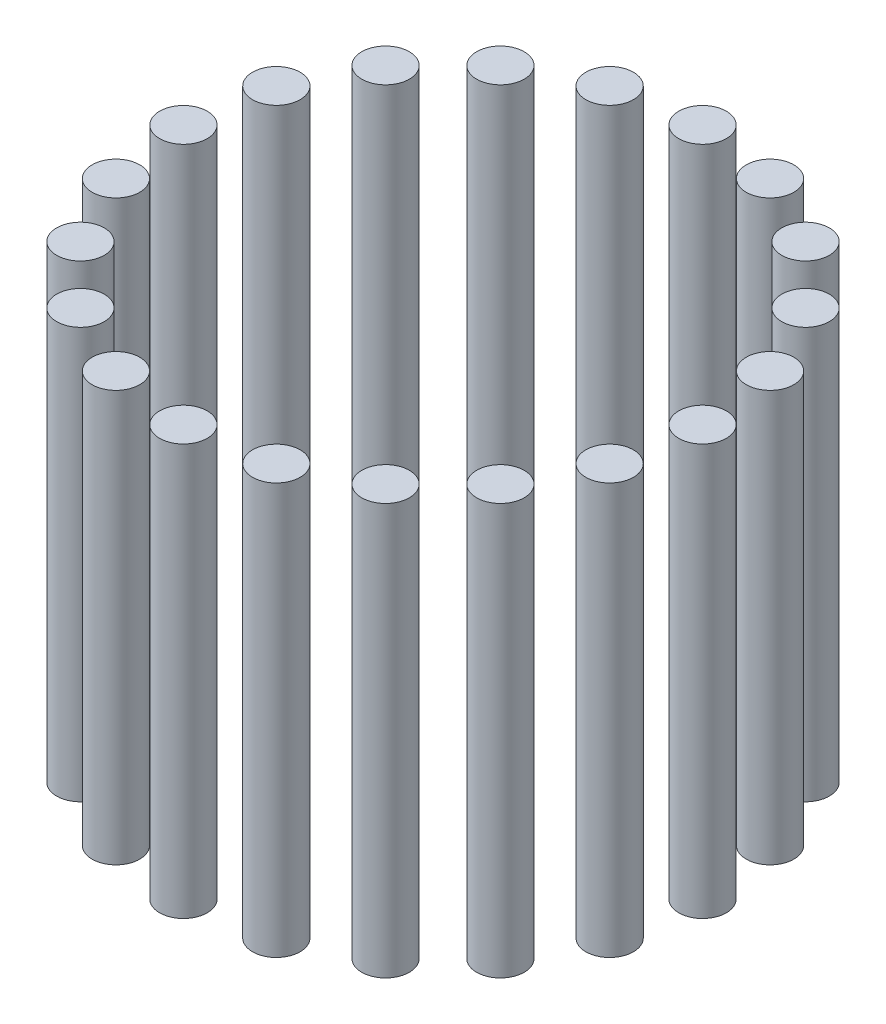
ISO-10303-21;
HEADER;
FILE_DESCRIPTION(('STEP AP214'),'2;1');
FILE_NAME('part.step','',(''),(''),'','','');
FILE_SCHEMA(('AUTOMOTIVE_DESIGN { 1 0 10303 214 1 1 1 1 }'));
ENDSEC;
DATA;
#1=APPLICATION_CONTEXT('core data for automotive mechanical design processes');
#2=APPLICATION_PROTOCOL_DEFINITION('international standard','automotive_design',2000,#1);
#3=PRODUCT_CONTEXT('',#1,'mechanical');
#4=PRODUCT('Part','Part','',(#3));
#5=PRODUCT_RELATED_PRODUCT_CATEGORY('part','',(#4));
#6=PRODUCT_DEFINITION_FORMATION('','',#4);
#7=PRODUCT_DEFINITION_CONTEXT('part definition',#1,'design');
#8=PRODUCT_DEFINITION('design','',#6,#7);
#9=PRODUCT_DEFINITION_SHAPE('','',#8);
#10=(LENGTH_UNIT() NAMED_UNIT(*) SI_UNIT(.MILLI.,.METRE.));
#11=(NAMED_UNIT(*) PLANE_ANGLE_UNIT() SI_UNIT($,.RADIAN.));
#12=(NAMED_UNIT(*) SI_UNIT($,.STERADIAN.) SOLID_ANGLE_UNIT());
#13=UNCERTAINTY_MEASURE_WITH_UNIT(LENGTH_MEASURE(1.E-05),#10,'distance_accuracy_value','');
#14=(GEOMETRIC_REPRESENTATION_CONTEXT(3) GLOBAL_UNCERTAINTY_ASSIGNED_CONTEXT((#13)) GLOBAL_UNIT_ASSIGNED_CONTEXT((#10,
#11,#12)) REPRESENTATION_CONTEXT('',''));
#15=CARTESIAN_POINT('',(0.,0.,0.));
#16=DIRECTION('',(0.,0.,1.));
#17=DIRECTION('',(1.,0.,0.));
#18=AXIS2_PLACEMENT_3D('',#15,#16,#17);
#19=CARTESIAN_POINT('',(0.,0.,0.));
#20=DIRECTION('',(0.,1.,0.));
#21=DIRECTION('',(0.,0.,1.));
#22=AXIS2_PLACEMENT_3D('',#19,#20,#21);
#23=PLANE('',#22);
#24=CARTESIAN_POINT('',(-57.0633909777092,0.,-18.5410196624969));
#25=DIRECTION('',(0.,1.,0.));
#26=DIRECTION('',(0.,0.,1.));
#27=AXIS2_PLACEMENT_3D('',#24,#25,#26);
#28=CIRCLE('',#27,5.5);
#29=CARTESIAN_POINT('',(-57.0633909777092,0.,-13.0410196624969));
#30=VERTEX_POINT('',#29);
#31=EDGE_CURVE('E12',#30,#30,#28,.T.);
#32=ORIENTED_EDGE('',*,*,#31,.F.);
#33=EDGE_LOOP('',(#32));
#34=FACE_BOUND('',#33,.T.);
#35=ADVANCED_FACE('F55',(#34),#23,.F.);
#36=CARTESIAN_POINT('',(-57.0633909777092,95.,-18.5410196624969));
#37=DIRECTION('',(0.,-1.,0.));
#38=DIRECTION('',(0.,0.,-1.));
#39=AXIS2_PLACEMENT_3D('',#36,#37,#38);
#40=CYLINDRICAL_SURFACE('',#39,5.5);
#41=ORIENTED_EDGE('',*,*,#31,.T.);
#42=EDGE_LOOP('',(#41));
#43=FACE_BOUND('',#42,.T.);
#44=CARTESIAN_POINT('',(-57.0633909777092,95.,-18.5410196624969));
#45=DIRECTION('',(0.,1.,0.));
#46=DIRECTION('',(0.,0.,1.));
#47=AXIS2_PLACEMENT_3D('',#44,#45,#46);
#48=CIRCLE('',#47,5.5);
#49=CARTESIAN_POINT('',(-57.0633909777092,95.,-13.0410196624969));
#50=VERTEX_POINT('',#49);
#51=EDGE_CURVE('E59',#50,#50,#48,.T.);
#52=ORIENTED_EDGE('',*,*,#51,.F.);
#53=EDGE_LOOP('',(#52));
#54=FACE_BOUND('',#53,.T.);
#55=ADVANCED_FACE('F69',(#43,#54),#40,.T.);
#56=CARTESIAN_POINT('',(0.,95.,0.));
#57=DIRECTION('',(0.,1.,0.));
#58=DIRECTION('',(0.,0.,1.));
#59=AXIS2_PLACEMENT_3D('',#56,#57,#58);
#60=PLANE('',#59);
#61=ORIENTED_EDGE('',*,*,#51,.T.);
#62=EDGE_LOOP('',(#61));
#63=FACE_BOUND('',#62,.T.);
#64=ADVANCED_FACE('F57',(#63),#60,.T.);
#65=CLOSED_SHELL('',(#35,#55,#64));
#66=MANIFOLD_SOLID_BREP('B2',#65);
#67=CARTESIAN_POINT('',(-60.,95.,0.));
#68=DIRECTION('',(0.,-1.,0.));
#69=DIRECTION('',(0.,0.,-1.));
#70=AXIS2_PLACEMENT_3D('',#67,#68,#69);
#71=CYLINDRICAL_SURFACE('',#70,5.5);
#72=CARTESIAN_POINT('',(-60.,95.,0.));
#73=DIRECTION('',(0.,1.,0.));
#74=DIRECTION('',(0.,0.,1.));
#75=AXIS2_PLACEMENT_3D('',#72,#73,#74);
#76=CIRCLE('',#75,5.5);
#77=CARTESIAN_POINT('',(-60.,95.,5.5));
#78=VERTEX_POINT('',#77);
#79=EDGE_CURVE('E117',#78,#78,#76,.T.);
#80=ORIENTED_EDGE('',*,*,#79,.F.);
#81=EDGE_LOOP('',(#80));
#82=FACE_BOUND('',#81,.T.);
#83=CARTESIAN_POINT('',(-60.,0.,0.));
#84=DIRECTION('',(0.,1.,0.));
#85=DIRECTION('',(0.,0.,1.));
#86=AXIS2_PLACEMENT_3D('',#83,#84,#85);
#87=CIRCLE('',#86,5.5);
#88=CARTESIAN_POINT('',(-60.,0.,5.5));
#89=VERTEX_POINT('',#88);
#90=EDGE_CURVE('E54',#89,#89,#87,.T.);
#91=ORIENTED_EDGE('',*,*,#90,.T.);
#92=EDGE_LOOP('',(#91));
#93=FACE_BOUND('',#92,.T.);
#94=ADVANCED_FACE('F113',(#82,#93),#71,.T.);
#95=CARTESIAN_POINT('',(-60.,95.,0.));
#96=DIRECTION('',(0.,1.,0.));
#97=DIRECTION('',(0.,0.,1.));
#98=AXIS2_PLACEMENT_3D('',#95,#96,#97);
#99=PLANE('',#98);
#100=ORIENTED_EDGE('',*,*,#79,.T.);
#101=EDGE_LOOP('',(#100));
#102=FACE_BOUND('',#101,.T.);
#103=ADVANCED_FACE('F115',(#102),#99,.T.);
#104=CARTESIAN_POINT('',(-60.,0.,0.));
#105=DIRECTION('',(0.,1.,0.));
#106=DIRECTION('',(0.,0.,1.));
#107=AXIS2_PLACEMENT_3D('',#104,#105,#106);
#108=PLANE('',#107);
#109=ORIENTED_EDGE('',*,*,#90,.F.);
#110=EDGE_LOOP('',(#109));
#111=FACE_BOUND('',#110,.T.);
#112=ADVANCED_FACE('F132',(#111),#108,.F.);
#113=CLOSED_SHELL('',(#94,#103,#112));
#114=MANIFOLD_SOLID_BREP('B7',#113);
#115=CARTESIAN_POINT('',(-57.0633909777094,95.,18.5410196624961));
#116=DIRECTION('',(0.,-1.,0.));
#117=DIRECTION('',(0.,0.,-1.));
#118=AXIS2_PLACEMENT_3D('',#115,#116,#117);
#119=CYLINDRICAL_SURFACE('',#118,5.5);
#120=CARTESIAN_POINT('',(-57.0633909777094,95.,18.5410196624961));
#121=DIRECTION('',(0.,1.,0.));
#122=DIRECTION('',(0.,0.,1.));
#123=AXIS2_PLACEMENT_3D('',#120,#121,#122);
#124=CIRCLE('',#123,5.5);
#125=CARTESIAN_POINT('',(-57.0633909777094,95.,24.0410196624961));
#126=VERTEX_POINT('',#125);
#127=EDGE_CURVE('E172',#126,#126,#124,.T.);
#128=ORIENTED_EDGE('',*,*,#127,.F.);
#129=EDGE_LOOP('',(#128));
#130=FACE_BOUND('',#129,.T.);
#131=CARTESIAN_POINT('',(-57.0633909777094,0.,18.5410196624961));
#132=DIRECTION('',(0.,1.,0.));
#133=DIRECTION('',(0.,0.,1.));
#134=AXIS2_PLACEMENT_3D('',#131,#132,#133);
#135=CIRCLE('',#134,5.5);
#136=CARTESIAN_POINT('',(-57.0633909777094,0.,24.0410196624961));
#137=VERTEX_POINT('',#136);
#138=EDGE_CURVE('E112',#137,#137,#135,.T.);
#139=ORIENTED_EDGE('',*,*,#138,.T.);
#140=EDGE_LOOP('',(#139));
#141=FACE_BOUND('',#140,.T.);
#142=ADVANCED_FACE('F168',(#130,#141),#119,.T.);
#143=CARTESIAN_POINT('',(-57.0633909777094,95.,18.5410196624961));
#144=DIRECTION('',(0.,1.,0.));
#145=DIRECTION('',(0.,0.,1.));
#146=AXIS2_PLACEMENT_3D('',#143,#144,#145);
#147=PLANE('',#146);
#148=ORIENTED_EDGE('',*,*,#127,.T.);
#149=EDGE_LOOP('',(#148));
#150=FACE_BOUND('',#149,.T.);
#151=ADVANCED_FACE('F170',(#150),#147,.T.);
#152=CARTESIAN_POINT('',(-57.0633909777094,0.,18.5410196624961));
#153=DIRECTION('',(0.,1.,0.));
#154=DIRECTION('',(0.,0.,1.));
#155=AXIS2_PLACEMENT_3D('',#152,#153,#154);
#156=PLANE('',#155);
#157=ORIENTED_EDGE('',*,*,#138,.F.);
#158=EDGE_LOOP('',(#157));
#159=FACE_BOUND('',#158,.T.);
#160=ADVANCED_FACE('F187',(#159),#156,.F.);
#161=CLOSED_SHELL('',(#142,#151,#160));
#162=MANIFOLD_SOLID_BREP('B49',#161);
#163=CARTESIAN_POINT('',(-48.5410196624968,95.,-35.2671151375485));
#164=DIRECTION('',(0.,-1.,0.));
#165=DIRECTION('',(0.,0.,-1.));
#166=AXIS2_PLACEMENT_3D('',#163,#164,#165);
#167=CYLINDRICAL_SURFACE('',#166,5.5);
#168=CARTESIAN_POINT('',(-48.5410196624968,95.,-35.2671151375485));
#169=DIRECTION('',(0.,1.,0.));
#170=DIRECTION('',(0.,0.,1.));
#171=AXIS2_PLACEMENT_3D('',#168,#169,#170);
#172=CIRCLE('',#171,5.5);
#173=CARTESIAN_POINT('',(-48.5410196624968,95.,-29.7671151375485));
#174=VERTEX_POINT('',#173);
#175=EDGE_CURVE('E227',#174,#174,#172,.T.);
#176=ORIENTED_EDGE('',*,*,#175,.F.);
#177=EDGE_LOOP('',(#176));
#178=FACE_BOUND('',#177,.T.);
#179=CARTESIAN_POINT('',(-48.5410196624968,0.,-35.2671151375485));
#180=DIRECTION('',(0.,1.,0.));
#181=DIRECTION('',(0.,0.,1.));
#182=AXIS2_PLACEMENT_3D('',#179,#180,#181);
#183=CIRCLE('',#182,5.5);
#184=CARTESIAN_POINT('',(-48.5410196624968,0.,-29.7671151375485));
#185=VERTEX_POINT('',#184);
#186=EDGE_CURVE('E167',#185,#185,#183,.T.);
#187=ORIENTED_EDGE('',*,*,#186,.T.);
#188=EDGE_LOOP('',(#187));
#189=FACE_BOUND('',#188,.T.);
#190=ADVANCED_FACE('F223',(#178,#189),#167,.T.);
#191=CARTESIAN_POINT('',(-48.5410196624968,95.,-35.2671151375485));
#192=DIRECTION('',(0.,1.,0.));
#193=DIRECTION('',(0.,0.,1.));
#194=AXIS2_PLACEMENT_3D('',#191,#192,#193);
#195=PLANE('',#194);
#196=ORIENTED_EDGE('',*,*,#175,.T.);
#197=EDGE_LOOP('',(#196));
#198=FACE_BOUND('',#197,.T.);
#199=ADVANCED_FACE('F225',(#198),#195,.T.);
#200=CARTESIAN_POINT('',(-48.5410196624968,0.,-35.2671151375485));
#201=DIRECTION('',(0.,1.,0.));
#202=DIRECTION('',(0.,0.,1.));
#203=AXIS2_PLACEMENT_3D('',#200,#201,#202);
#204=PLANE('',#203);
#205=ORIENTED_EDGE('',*,*,#186,.F.);
#206=EDGE_LOOP('',(#205));
#207=FACE_BOUND('',#206,.T.);
#208=ADVANCED_FACE('F242',(#207),#204,.F.);
#209=CLOSED_SHELL('',(#190,#199,#208));
#210=MANIFOLD_SOLID_BREP('B107',#209);
#211=CARTESIAN_POINT('',(-35.2671151375483,95.,-48.5410196624969));
#212=DIRECTION('',(0.,-1.,0.));
#213=DIRECTION('',(0.,0.,-1.));
#214=AXIS2_PLACEMENT_3D('',#211,#212,#213);
#215=CYLINDRICAL_SURFACE('',#214,5.5);
#216=CARTESIAN_POINT('',(-35.2671151375483,95.,-48.5410196624969));
#217=DIRECTION('',(0.,1.,0.));
#218=DIRECTION('',(0.,0.,1.));
#219=AXIS2_PLACEMENT_3D('',#216,#217,#218);
#220=CIRCLE('',#219,5.5);
#221=CARTESIAN_POINT('',(-35.2671151375483,95.,-43.0410196624969));
#222=VERTEX_POINT('',#221);
#223=EDGE_CURVE('E282',#222,#222,#220,.T.);
#224=ORIENTED_EDGE('',*,*,#223,.F.);
#225=EDGE_LOOP('',(#224));
#226=FACE_BOUND('',#225,.T.);
#227=CARTESIAN_POINT('',(-35.2671151375483,0.,-48.5410196624969));
#228=DIRECTION('',(0.,1.,0.));
#229=DIRECTION('',(0.,0.,1.));
#230=AXIS2_PLACEMENT_3D('',#227,#228,#229);
#231=CIRCLE('',#230,5.5);
#232=CARTESIAN_POINT('',(-35.2671151375483,0.,-43.0410196624969));
#233=VERTEX_POINT('',#232);
#234=EDGE_CURVE('E222',#233,#233,#231,.T.);
#235=ORIENTED_EDGE('',*,*,#234,.T.);
#236=EDGE_LOOP('',(#235));
#237=FACE_BOUND('',#236,.T.);
#238=ADVANCED_FACE('F278',(#226,#237),#215,.T.);
#239=CARTESIAN_POINT('',(-35.2671151375483,95.,-48.5410196624969));
#240=DIRECTION('',(0.,1.,0.));
#241=DIRECTION('',(0.,0.,1.));
#242=AXIS2_PLACEMENT_3D('',#239,#240,#241);
#243=PLANE('',#242);
#244=ORIENTED_EDGE('',*,*,#223,.T.);
#245=EDGE_LOOP('',(#244));
#246=FACE_BOUND('',#245,.T.);
#247=ADVANCED_FACE('F280',(#246),#243,.T.);
#248=CARTESIAN_POINT('',(-35.2671151375483,0.,-48.5410196624969));
#249=DIRECTION('',(0.,1.,0.));
#250=DIRECTION('',(0.,0.,1.));
#251=AXIS2_PLACEMENT_3D('',#248,#249,#250);
#252=PLANE('',#251);
#253=ORIENTED_EDGE('',*,*,#234,.F.);
#254=EDGE_LOOP('',(#253));
#255=FACE_BOUND('',#254,.T.);
#256=ADVANCED_FACE('F297',(#255),#252,.F.);
#257=CLOSED_SHELL('',(#238,#247,#256));
#258=MANIFOLD_SOLID_BREP('B162',#257);
#259=CARTESIAN_POINT('',(-18.5410196624967,95.,-57.0633909777093));
#260=DIRECTION('',(0.,-1.,0.));
#261=DIRECTION('',(0.,0.,-1.));
#262=AXIS2_PLACEMENT_3D('',#259,#260,#261);
#263=CYLINDRICAL_SURFACE('',#262,5.49999999999999);
#264=CARTESIAN_POINT('',(-18.5410196624967,95.,-57.0633909777093));
#265=DIRECTION('',(0.,1.,0.));
#266=DIRECTION('',(0.,0.,1.));
#267=AXIS2_PLACEMENT_3D('',#264,#265,#266);
#268=CIRCLE('',#267,5.49999999999999);
#269=CARTESIAN_POINT('',(-18.5410196624967,95.,-51.5633909777093));
#270=VERTEX_POINT('',#269);
#271=EDGE_CURVE('E337',#270,#270,#268,.T.);
#272=ORIENTED_EDGE('',*,*,#271,.F.);
#273=EDGE_LOOP('',(#272));
#274=FACE_BOUND('',#273,.T.);
#275=CARTESIAN_POINT('',(-18.5410196624967,0.,-57.0633909777093));
#276=DIRECTION('',(0.,1.,0.));
#277=DIRECTION('',(0.,0.,1.));
#278=AXIS2_PLACEMENT_3D('',#275,#276,#277);
#279=CIRCLE('',#278,5.49999999999999);
#280=CARTESIAN_POINT('',(-18.5410196624967,0.,-51.5633909777093));
#281=VERTEX_POINT('',#280);
#282=EDGE_CURVE('E277',#281,#281,#279,.T.);
#283=ORIENTED_EDGE('',*,*,#282,.T.);
#284=EDGE_LOOP('',(#283));
#285=FACE_BOUND('',#284,.T.);
#286=ADVANCED_FACE('F333',(#274,#285),#263,.T.);
#287=CARTESIAN_POINT('',(-18.5410196624967,95.,-57.0633909777093));
#288=DIRECTION('',(0.,1.,0.));
#289=DIRECTION('',(0.,0.,1.));
#290=AXIS2_PLACEMENT_3D('',#287,#288,#289);
#291=PLANE('',#290);
#292=ORIENTED_EDGE('',*,*,#271,.T.);
#293=EDGE_LOOP('',(#292));
#294=FACE_BOUND('',#293,.T.);
#295=ADVANCED_FACE('F335',(#294),#291,.T.);
#296=CARTESIAN_POINT('',(-18.5410196624967,0.,-57.0633909777093));
#297=DIRECTION('',(0.,1.,0.));
#298=DIRECTION('',(0.,0.,1.));
#299=AXIS2_PLACEMENT_3D('',#296,#297,#298);
#300=PLANE('',#299);
#301=ORIENTED_EDGE('',*,*,#282,.F.);
#302=EDGE_LOOP('',(#301));
#303=FACE_BOUND('',#302,.T.);
#304=ADVANCED_FACE('F352',(#303),#300,.F.);
#305=CLOSED_SHELL('',(#286,#295,#304));
#306=MANIFOLD_SOLID_BREP('B217',#305);
#307=CARTESIAN_POINT('',(2.09488880330588E-13,95.,-60.));
#308=DIRECTION('',(0.,-1.,0.));
#309=DIRECTION('',(0.,0.,-1.));
#310=AXIS2_PLACEMENT_3D('',#307,#308,#309);
#311=CYLINDRICAL_SURFACE('',#310,5.5);
#312=CARTESIAN_POINT('',(2.09488880330588E-13,95.,-60.));
#313=DIRECTION('',(0.,1.,0.));
#314=DIRECTION('',(0.,0.,1.));
#315=AXIS2_PLACEMENT_3D('',#312,#313,#314);
#316=CIRCLE('',#315,5.5);
#317=CARTESIAN_POINT('',(2.09488880330588E-13,95.,-54.5));
#318=VERTEX_POINT('',#317);
#319=EDGE_CURVE('E392',#318,#318,#316,.T.);
#320=ORIENTED_EDGE('',*,*,#319,.F.);
#321=EDGE_LOOP('',(#320));
#322=FACE_BOUND('',#321,.T.);
#323=CARTESIAN_POINT('',(2.09488880330588E-13,0.,-60.));
#324=DIRECTION('',(0.,1.,0.));
#325=DIRECTION('',(0.,0.,1.));
#326=AXIS2_PLACEMENT_3D('',#323,#324,#325);
#327=CIRCLE('',#326,5.5);
#328=CARTESIAN_POINT('',(2.09488880330588E-13,0.,-54.5));
#329=VERTEX_POINT('',#328);
#330=EDGE_CURVE('E332',#329,#329,#327,.T.);
#331=ORIENTED_EDGE('',*,*,#330,.T.);
#332=EDGE_LOOP('',(#331));
#333=FACE_BOUND('',#332,.T.);
#334=ADVANCED_FACE('F388',(#322,#333),#311,.T.);
#335=CARTESIAN_POINT('',(2.09488880330588E-13,95.,-60.));
#336=DIRECTION('',(0.,1.,0.));
#337=DIRECTION('',(0.,0.,1.));
#338=AXIS2_PLACEMENT_3D('',#335,#336,#337);
#339=PLANE('',#338);
#340=ORIENTED_EDGE('',*,*,#319,.T.);
#341=EDGE_LOOP('',(#340));
#342=FACE_BOUND('',#341,.T.);
#343=ADVANCED_FACE('F390',(#342),#339,.T.);
#344=CARTESIAN_POINT('',(2.09488880330588E-13,0.,-60.));
#345=DIRECTION('',(0.,1.,0.));
#346=DIRECTION('',(0.,0.,1.));
#347=AXIS2_PLACEMENT_3D('',#344,#345,#346);
#348=PLANE('',#347);
#349=ORIENTED_EDGE('',*,*,#330,.F.);
#350=EDGE_LOOP('',(#349));
#351=FACE_BOUND('',#350,.T.);
#352=ADVANCED_FACE('F407',(#351),#348,.F.);
#353=CLOSED_SHELL('',(#334,#343,#352));
#354=MANIFOLD_SOLID_BREP('B272',#353);
#355=CARTESIAN_POINT('',(18.5410196624971,95.,-57.0633909777091));
#356=DIRECTION('',(0.,-1.,0.));
#357=DIRECTION('',(0.,0.,-1.));
#358=AXIS2_PLACEMENT_3D('',#355,#356,#357);
#359=CYLINDRICAL_SURFACE('',#358,5.49999999999999);
#360=CARTESIAN_POINT('',(18.5410196624971,95.,-57.0633909777091));
#361=DIRECTION('',(0.,1.,0.));
#362=DIRECTION('',(0.,0.,1.));
#363=AXIS2_PLACEMENT_3D('',#360,#361,#362);
#364=CIRCLE('',#363,5.49999999999999);
#365=CARTESIAN_POINT('',(18.5410196624971,95.,-51.5633909777091));
#366=VERTEX_POINT('',#365);
#367=EDGE_CURVE('E447',#366,#366,#364,.T.);
#368=ORIENTED_EDGE('',*,*,#367,.F.);
#369=EDGE_LOOP('',(#368));
#370=FACE_BOUND('',#369,.T.);
#371=CARTESIAN_POINT('',(18.5410196624971,0.,-57.0633909777091));
#372=DIRECTION('',(0.,1.,0.));
#373=DIRECTION('',(0.,0.,1.));
#374=AXIS2_PLACEMENT_3D('',#371,#372,#373);
#375=CIRCLE('',#374,5.49999999999999);
#376=CARTESIAN_POINT('',(18.5410196624971,0.,-51.5633909777091));
#377=VERTEX_POINT('',#376);
#378=EDGE_CURVE('E387',#377,#377,#375,.T.);
#379=ORIENTED_EDGE('',*,*,#378,.T.);
#380=EDGE_LOOP('',(#379));
#381=FACE_BOUND('',#380,.T.);
#382=ADVANCED_FACE('F443',(#370,#381),#359,.T.);
#383=CARTESIAN_POINT('',(18.5410196624971,95.,-57.0633909777091));
#384=DIRECTION('',(0.,1.,0.));
#385=DIRECTION('',(0.,0.,1.));
#386=AXIS2_PLACEMENT_3D('',#383,#384,#385);
#387=PLANE('',#386);
#388=ORIENTED_EDGE('',*,*,#367,.T.);
#389=EDGE_LOOP('',(#388));
#390=FACE_BOUND('',#389,.T.);
#391=ADVANCED_FACE('F445',(#390),#387,.T.);
#392=CARTESIAN_POINT('',(18.5410196624971,0.,-57.0633909777091));
#393=DIRECTION('',(0.,1.,0.));
#394=DIRECTION('',(0.,0.,1.));
#395=AXIS2_PLACEMENT_3D('',#392,#393,#394);
#396=PLANE('',#395);
#397=ORIENTED_EDGE('',*,*,#378,.F.);
#398=EDGE_LOOP('',(#397));
#399=FACE_BOUND('',#398,.T.);
#400=ADVANCED_FACE('F462',(#399),#396,.F.);
#401=CLOSED_SHELL('',(#382,#391,#400));
#402=MANIFOLD_SOLID_BREP('B327',#401);
#403=CARTESIAN_POINT('',(35.2671151375486,95.,-48.5410196624967));
#404=DIRECTION('',(0.,-1.,0.));
#405=DIRECTION('',(0.,0.,-1.));
#406=AXIS2_PLACEMENT_3D('',#403,#404,#405);
#407=CYLINDRICAL_SURFACE('',#406,5.49999999999999);
#408=CARTESIAN_POINT('',(35.2671151375486,95.,-48.5410196624967));
#409=DIRECTION('',(0.,1.,0.));
#410=DIRECTION('',(0.,0.,1.));
#411=AXIS2_PLACEMENT_3D('',#408,#409,#410);
#412=CIRCLE('',#411,5.49999999999999);
#413=CARTESIAN_POINT('',(35.2671151375486,95.,-43.0410196624967));
#414=VERTEX_POINT('',#413);
#415=EDGE_CURVE('E502',#414,#414,#412,.T.);
#416=ORIENTED_EDGE('',*,*,#415,.F.);
#417=EDGE_LOOP('',(#416));
#418=FACE_BOUND('',#417,.T.);
#419=CARTESIAN_POINT('',(35.2671151375486,0.,-48.5410196624967));
#420=DIRECTION('',(0.,1.,0.));
#421=DIRECTION('',(0.,0.,1.));
#422=AXIS2_PLACEMENT_3D('',#419,#420,#421);
#423=CIRCLE('',#422,5.49999999999999);
#424=CARTESIAN_POINT('',(35.2671151375486,0.,-43.0410196624967));
#425=VERTEX_POINT('',#424);
#426=EDGE_CURVE('E442',#425,#425,#423,.T.);
#427=ORIENTED_EDGE('',*,*,#426,.T.);
#428=EDGE_LOOP('',(#427));
#429=FACE_BOUND('',#428,.T.);
#430=ADVANCED_FACE('F498',(#418,#429),#407,.T.);
#431=CARTESIAN_POINT('',(35.2671151375486,95.,-48.5410196624967));
#432=DIRECTION('',(0.,1.,0.));
#433=DIRECTION('',(0.,0.,1.));
#434=AXIS2_PLACEMENT_3D('',#431,#432,#433);
#435=PLANE('',#434);
#436=ORIENTED_EDGE('',*,*,#415,.T.);
#437=EDGE_LOOP('',(#436));
#438=FACE_BOUND('',#437,.T.);
#439=ADVANCED_FACE('F500',(#438),#435,.T.);
#440=CARTESIAN_POINT('',(35.2671151375486,0.,-48.5410196624967));
#441=DIRECTION('',(0.,1.,0.));
#442=DIRECTION('',(0.,0.,1.));
#443=AXIS2_PLACEMENT_3D('',#440,#441,#442);
#444=PLANE('',#443);
#445=ORIENTED_EDGE('',*,*,#426,.F.);
#446=EDGE_LOOP('',(#445));
#447=FACE_BOUND('',#446,.T.);
#448=ADVANCED_FACE('F517',(#447),#444,.F.);
#449=CLOSED_SHELL('',(#430,#439,#448));
#450=MANIFOLD_SOLID_BREP('B382',#449);
#451=CARTESIAN_POINT('',(48.541019662497,95.,-35.2671151375481));
#452=DIRECTION('',(0.,-1.,0.));
#453=DIRECTION('',(0.,0.,-1.));
#454=AXIS2_PLACEMENT_3D('',#451,#452,#453);
#455=CYLINDRICAL_SURFACE('',#454,5.5);
#456=CARTESIAN_POINT('',(48.541019662497,95.,-35.2671151375481));
#457=DIRECTION('',(0.,1.,0.));
#458=DIRECTION('',(0.,0.,1.));
#459=AXIS2_PLACEMENT_3D('',#456,#457,#458);
#460=CIRCLE('',#459,5.5);
#461=CARTESIAN_POINT('',(48.541019662497,95.,-29.7671151375481));
#462=VERTEX_POINT('',#461);
#463=EDGE_CURVE('E557',#462,#462,#460,.T.);
#464=ORIENTED_EDGE('',*,*,#463,.F.);
#465=EDGE_LOOP('',(#464));
#466=FACE_BOUND('',#465,.T.);
#467=CARTESIAN_POINT('',(48.541019662497,0.,-35.2671151375481));
#468=DIRECTION('',(0.,1.,0.));
#469=DIRECTION('',(0.,0.,1.));
#470=AXIS2_PLACEMENT_3D('',#467,#468,#469);
#471=CIRCLE('',#470,5.5);
#472=CARTESIAN_POINT('',(48.541019662497,0.,-29.7671151375481));
#473=VERTEX_POINT('',#472);
#474=EDGE_CURVE('E497',#473,#473,#471,.T.);
#475=ORIENTED_EDGE('',*,*,#474,.T.);
#476=EDGE_LOOP('',(#475));
#477=FACE_BOUND('',#476,.T.);
#478=ADVANCED_FACE('F553',(#466,#477),#455,.T.);
#479=CARTESIAN_POINT('',(48.541019662497,95.,-35.2671151375481));
#480=DIRECTION('',(0.,1.,0.));
#481=DIRECTION('',(0.,0.,1.));
#482=AXIS2_PLACEMENT_3D('',#479,#480,#481);
#483=PLANE('',#482);
#484=ORIENTED_EDGE('',*,*,#463,.T.);
#485=EDGE_LOOP('',(#484));
#486=FACE_BOUND('',#485,.T.);
#487=ADVANCED_FACE('F555',(#486),#483,.T.);
#488=CARTESIAN_POINT('',(48.541019662497,0.,-35.2671151375481));
#489=DIRECTION('',(0.,1.,0.));
#490=DIRECTION('',(0.,0.,1.));
#491=AXIS2_PLACEMENT_3D('',#488,#489,#490);
#492=PLANE('',#491);
#493=ORIENTED_EDGE('',*,*,#474,.F.);
#494=EDGE_LOOP('',(#493));
#495=FACE_BOUND('',#494,.T.);
#496=ADVANCED_FACE('F572',(#495),#492,.F.);
#497=CLOSED_SHELL('',(#478,#487,#496));
#498=MANIFOLD_SOLID_BREP('B437',#497);
#499=CARTESIAN_POINT('',(57.0633909777093,95.,-18.5410196624965));
#500=DIRECTION('',(0.,-1.,0.));
#501=DIRECTION('',(0.,0.,-1.));
#502=AXIS2_PLACEMENT_3D('',#499,#500,#501);
#503=CYLINDRICAL_SURFACE('',#502,5.49999999999999);
#504=CARTESIAN_POINT('',(57.0633909777093,95.,-18.5410196624965));
#505=DIRECTION('',(0.,1.,0.));
#506=DIRECTION('',(0.,0.,1.));
#507=AXIS2_PLACEMENT_3D('',#504,#505,#506);
#508=CIRCLE('',#507,5.49999999999999);
#509=CARTESIAN_POINT('',(57.0633909777093,95.,-13.0410196624965));
#510=VERTEX_POINT('',#509);
#511=EDGE_CURVE('E612',#510,#510,#508,.T.);
#512=ORIENTED_EDGE('',*,*,#511,.F.);
#513=EDGE_LOOP('',(#512));
#514=FACE_BOUND('',#513,.T.);
#515=CARTESIAN_POINT('',(57.0633909777093,0.,-18.5410196624965));
#516=DIRECTION('',(0.,1.,0.));
#517=DIRECTION('',(0.,0.,1.));
#518=AXIS2_PLACEMENT_3D('',#515,#516,#517);
#519=CIRCLE('',#518,5.49999999999999);
#520=CARTESIAN_POINT('',(57.0633909777093,0.,-13.0410196624965));
#521=VERTEX_POINT('',#520);
#522=EDGE_CURVE('E552',#521,#521,#519,.T.);
#523=ORIENTED_EDGE('',*,*,#522,.T.);
#524=EDGE_LOOP('',(#523));
#525=FACE_BOUND('',#524,.T.);
#526=ADVANCED_FACE('F608',(#514,#525),#503,.T.);
#527=CARTESIAN_POINT('',(57.0633909777093,95.,-18.5410196624965));
#528=DIRECTION('',(0.,1.,0.));
#529=DIRECTION('',(0.,0.,1.));
#530=AXIS2_PLACEMENT_3D('',#527,#528,#529);
#531=PLANE('',#530);
#532=ORIENTED_EDGE('',*,*,#511,.T.);
#533=EDGE_LOOP('',(#532));
#534=FACE_BOUND('',#533,.T.);
#535=ADVANCED_FACE('F610',(#534),#531,.T.);
#536=CARTESIAN_POINT('',(57.0633909777093,0.,-18.5410196624965));
#537=DIRECTION('',(0.,1.,0.));
#538=DIRECTION('',(0.,0.,1.));
#539=AXIS2_PLACEMENT_3D('',#536,#537,#538);
#540=PLANE('',#539);
#541=ORIENTED_EDGE('',*,*,#522,.F.);
#542=EDGE_LOOP('',(#541));
#543=FACE_BOUND('',#542,.T.);
#544=ADVANCED_FACE('F627',(#543),#540,.F.);
#545=CLOSED_SHELL('',(#526,#535,#544));
#546=MANIFOLD_SOLID_BREP('B492',#545);
#547=CARTESIAN_POINT('',(60.,95.,4.18977760661176E-13));
#548=DIRECTION('',(0.,-1.,0.));
#549=DIRECTION('',(0.,0.,-1.));
#550=AXIS2_PLACEMENT_3D('',#547,#548,#549);
#551=CYLINDRICAL_SURFACE('',#550,5.5);
#552=CARTESIAN_POINT('',(60.,95.,4.18977760661176E-13));
#553=DIRECTION('',(0.,1.,0.));
#554=DIRECTION('',(0.,0.,1.));
#555=AXIS2_PLACEMENT_3D('',#552,#553,#554);
#556=CIRCLE('',#555,5.5);
#557=CARTESIAN_POINT('',(60.,95.,5.50000000000042));
#558=VERTEX_POINT('',#557);
#559=EDGE_CURVE('E667',#558,#558,#556,.T.);
#560=ORIENTED_EDGE('',*,*,#559,.F.);
#561=EDGE_LOOP('',(#560));
#562=FACE_BOUND('',#561,.T.);
#563=CARTESIAN_POINT('',(60.,0.,4.18977760661176E-13));
#564=DIRECTION('',(0.,1.,0.));
#565=DIRECTION('',(0.,0.,1.));
#566=AXIS2_PLACEMENT_3D('',#563,#564,#565);
#567=CIRCLE('',#566,5.5);
#568=CARTESIAN_POINT('',(60.,0.,5.50000000000042));
#569=VERTEX_POINT('',#568);
#570=EDGE_CURVE('E607',#569,#569,#567,.T.);
#571=ORIENTED_EDGE('',*,*,#570,.T.);
#572=EDGE_LOOP('',(#571));
#573=FACE_BOUND('',#572,.T.);
#574=ADVANCED_FACE('F663',(#562,#573),#551,.T.);
#575=CARTESIAN_POINT('',(60.,95.,4.18977760661176E-13));
#576=DIRECTION('',(0.,1.,0.));
#577=DIRECTION('',(0.,0.,1.));
#578=AXIS2_PLACEMENT_3D('',#575,#576,#577);
#579=PLANE('',#578);
#580=ORIENTED_EDGE('',*,*,#559,.T.);
#581=EDGE_LOOP('',(#580));
#582=FACE_BOUND('',#581,.T.);
#583=ADVANCED_FACE('F665',(#582),#579,.T.);
#584=CARTESIAN_POINT('',(60.,0.,4.18977760661176E-13));
#585=DIRECTION('',(0.,1.,0.));
#586=DIRECTION('',(0.,0.,1.));
#587=AXIS2_PLACEMENT_3D('',#584,#585,#586);
#588=PLANE('',#587);
#589=ORIENTED_EDGE('',*,*,#570,.F.);
#590=EDGE_LOOP('',(#589));
#591=FACE_BOUND('',#590,.T.);
#592=ADVANCED_FACE('F682',(#591),#588,.F.);
#593=CLOSED_SHELL('',(#574,#583,#592));
#594=MANIFOLD_SOLID_BREP('B547',#593);
#595=CARTESIAN_POINT('',(57.0633909777091,95.,18.5410196624973));
#596=DIRECTION('',(0.,-1.,0.));
#597=DIRECTION('',(0.,0.,-1.));
#598=AXIS2_PLACEMENT_3D('',#595,#596,#597);
#599=CYLINDRICAL_SURFACE('',#598,5.49999999999999);
#600=CARTESIAN_POINT('',(57.0633909777091,95.,18.5410196624973));
#601=DIRECTION('',(0.,1.,0.));
#602=DIRECTION('',(0.,0.,1.));
#603=AXIS2_PLACEMENT_3D('',#600,#601,#602);
#604=CIRCLE('',#603,5.49999999999999);
#605=CARTESIAN_POINT('',(57.0633909777091,95.,24.0410196624973));
#606=VERTEX_POINT('',#605);
#607=EDGE_CURVE('E722',#606,#606,#604,.T.);
#608=ORIENTED_EDGE('',*,*,#607,.F.);
#609=EDGE_LOOP('',(#608));
#610=FACE_BOUND('',#609,.T.);
#611=CARTESIAN_POINT('',(57.0633909777091,0.,18.5410196624973));
#612=DIRECTION('',(0.,1.,0.));
#613=DIRECTION('',(0.,0.,1.));
#614=AXIS2_PLACEMENT_3D('',#611,#612,#613);
#615=CIRCLE('',#614,5.49999999999999);
#616=CARTESIAN_POINT('',(57.0633909777091,0.,24.0410196624973));
#617=VERTEX_POINT('',#616);
#618=EDGE_CURVE('E662',#617,#617,#615,.T.);
#619=ORIENTED_EDGE('',*,*,#618,.T.);
#620=EDGE_LOOP('',(#619));
#621=FACE_BOUND('',#620,.T.);
#622=ADVANCED_FACE('F718',(#610,#621),#599,.T.);
#623=CARTESIAN_POINT('',(57.0633909777091,95.,18.5410196624973));
#624=DIRECTION('',(0.,1.,0.));
#625=DIRECTION('',(0.,0.,1.));
#626=AXIS2_PLACEMENT_3D('',#623,#624,#625);
#627=PLANE('',#626);
#628=ORIENTED_EDGE('',*,*,#607,.T.);
#629=EDGE_LOOP('',(#628));
#630=FACE_BOUND('',#629,.T.);
#631=ADVANCED_FACE('F720',(#630),#627,.T.);
#632=CARTESIAN_POINT('',(57.0633909777091,0.,18.5410196624973));
#633=DIRECTION('',(0.,1.,0.));
#634=DIRECTION('',(0.,0.,1.));
#635=AXIS2_PLACEMENT_3D('',#632,#633,#634);
#636=PLANE('',#635);
#637=ORIENTED_EDGE('',*,*,#618,.F.);
#638=EDGE_LOOP('',(#637));
#639=FACE_BOUND('',#638,.T.);
#640=ADVANCED_FACE('F737',(#639),#636,.F.);
#641=CLOSED_SHELL('',(#622,#631,#640));
#642=MANIFOLD_SOLID_BREP('B602',#641);
#643=CARTESIAN_POINT('',(48.5410196624965,95.,35.2671151375488));
#644=DIRECTION('',(0.,-1.,0.));
#645=DIRECTION('',(0.,0.,-1.));
#646=AXIS2_PLACEMENT_3D('',#643,#644,#645);
#647=CYLINDRICAL_SURFACE('',#646,5.5);
#648=CARTESIAN_POINT('',(48.5410196624965,95.,35.2671151375488));
#649=DIRECTION('',(0.,1.,0.));
#650=DIRECTION('',(0.,0.,1.));
#651=AXIS2_PLACEMENT_3D('',#648,#649,#650);
#652=CIRCLE('',#651,5.5);
#653=CARTESIAN_POINT('',(48.5410196624965,95.,40.7671151375488));
#654=VERTEX_POINT('',#653);
#655=EDGE_CURVE('E777',#654,#654,#652,.T.);
#656=ORIENTED_EDGE('',*,*,#655,.F.);
#657=EDGE_LOOP('',(#656));
#658=FACE_BOUND('',#657,.T.);
#659=CARTESIAN_POINT('',(48.5410196624965,0.,35.2671151375488));
#660=DIRECTION('',(0.,1.,0.));
#661=DIRECTION('',(0.,0.,1.));
#662=AXIS2_PLACEMENT_3D('',#659,#660,#661);
#663=CIRCLE('',#662,5.5);
#664=CARTESIAN_POINT('',(48.5410196624965,0.,40.7671151375488));
#665=VERTEX_POINT('',#664);
#666=EDGE_CURVE('E717',#665,#665,#663,.T.);
#667=ORIENTED_EDGE('',*,*,#666,.T.);
#668=EDGE_LOOP('',(#667));
#669=FACE_BOUND('',#668,.T.);
#670=ADVANCED_FACE('F773',(#658,#669),#647,.T.);
#671=CARTESIAN_POINT('',(48.5410196624965,95.,35.2671151375488));
#672=DIRECTION('',(0.,1.,0.));
#673=DIRECTION('',(0.,0.,1.));
#674=AXIS2_PLACEMENT_3D('',#671,#672,#673);
#675=PLANE('',#674);
#676=ORIENTED_EDGE('',*,*,#655,.T.);
#677=EDGE_LOOP('',(#676));
#678=FACE_BOUND('',#677,.T.);
#679=ADVANCED_FACE('F775',(#678),#675,.T.);
#680=CARTESIAN_POINT('',(48.5410196624965,0.,35.2671151375488));
#681=DIRECTION('',(0.,1.,0.));
#682=DIRECTION('',(0.,0.,1.));
#683=AXIS2_PLACEMENT_3D('',#680,#681,#682);
#684=PLANE('',#683);
#685=ORIENTED_EDGE('',*,*,#666,.F.);
#686=EDGE_LOOP('',(#685));
#687=FACE_BOUND('',#686,.T.);
#688=ADVANCED_FACE('F792',(#687),#684,.F.);
#689=CLOSED_SHELL('',(#670,#679,#688));
#690=MANIFOLD_SOLID_BREP('B657',#689);
#691=CARTESIAN_POINT('',(35.2671151375479,95.,48.5410196624972));
#692=DIRECTION('',(0.,-1.,0.));
#693=DIRECTION('',(0.,0.,-1.));
#694=AXIS2_PLACEMENT_3D('',#691,#692,#693);
#695=CYLINDRICAL_SURFACE('',#694,5.5);
#696=CARTESIAN_POINT('',(35.2671151375479,95.,48.5410196624972));
#697=DIRECTION('',(0.,1.,0.));
#698=DIRECTION('',(0.,0.,1.));
#699=AXIS2_PLACEMENT_3D('',#696,#697,#698);
#700=CIRCLE('',#699,5.5);
#701=CARTESIAN_POINT('',(35.2671151375479,95.,54.0410196624972));
#702=VERTEX_POINT('',#701);
#703=EDGE_CURVE('E832',#702,#702,#700,.T.);
#704=ORIENTED_EDGE('',*,*,#703,.F.);
#705=EDGE_LOOP('',(#704));
#706=FACE_BOUND('',#705,.T.);
#707=CARTESIAN_POINT('',(35.2671151375479,0.,48.5410196624972));
#708=DIRECTION('',(0.,1.,0.));
#709=DIRECTION('',(0.,0.,1.));
#710=AXIS2_PLACEMENT_3D('',#707,#708,#709);
#711=CIRCLE('',#710,5.5);
#712=CARTESIAN_POINT('',(35.2671151375479,0.,54.0410196624972));
#713=VERTEX_POINT('',#712);
#714=EDGE_CURVE('E772',#713,#713,#711,.T.);
#715=ORIENTED_EDGE('',*,*,#714,.T.);
#716=EDGE_LOOP('',(#715));
#717=FACE_BOUND('',#716,.T.);
#718=ADVANCED_FACE('F828',(#706,#717),#695,.T.);
#719=CARTESIAN_POINT('',(35.2671151375479,95.,48.5410196624972));
#720=DIRECTION('',(0.,1.,0.));
#721=DIRECTION('',(0.,0.,1.));
#722=AXIS2_PLACEMENT_3D('',#719,#720,#721);
#723=PLANE('',#722);
#724=ORIENTED_EDGE('',*,*,#703,.T.);
#725=EDGE_LOOP('',(#724));
#726=FACE_BOUND('',#725,.T.);
#727=ADVANCED_FACE('F830',(#726),#723,.T.);
#728=CARTESIAN_POINT('',(35.2671151375479,0.,48.5410196624972));
#729=DIRECTION('',(0.,1.,0.));
#730=DIRECTION('',(0.,0.,1.));
#731=AXIS2_PLACEMENT_3D('',#728,#729,#730);
#732=PLANE('',#731);
#733=ORIENTED_EDGE('',*,*,#714,.F.);
#734=EDGE_LOOP('',(#733));
#735=FACE_BOUND('',#734,.T.);
#736=ADVANCED_FACE('F847',(#735),#732,.F.);
#737=CLOSED_SHELL('',(#718,#727,#736));
#738=MANIFOLD_SOLID_BREP('B712',#737);
#739=CARTESIAN_POINT('',(18.5410196624963,95.,57.0633909777094));
#740=DIRECTION('',(0.,-1.,0.));
#741=DIRECTION('',(0.,0.,-1.));
#742=AXIS2_PLACEMENT_3D('',#739,#740,#741);
#743=CYLINDRICAL_SURFACE('',#742,5.5);
#744=CARTESIAN_POINT('',(18.5410196624963,95.,57.0633909777094));
#745=DIRECTION('',(0.,1.,0.));
#746=DIRECTION('',(0.,0.,1.));
#747=AXIS2_PLACEMENT_3D('',#744,#745,#746);
#748=CIRCLE('',#747,5.5);
#749=CARTESIAN_POINT('',(18.5410196624963,95.,62.5633909777094));
#750=VERTEX_POINT('',#749);
#751=EDGE_CURVE('E887',#750,#750,#748,.T.);
#752=ORIENTED_EDGE('',*,*,#751,.F.);
#753=EDGE_LOOP('',(#752));
#754=FACE_BOUND('',#753,.T.);
#755=CARTESIAN_POINT('',(18.5410196624963,0.,57.0633909777094));
#756=DIRECTION('',(0.,1.,0.));
#757=DIRECTION('',(0.,0.,1.));
#758=AXIS2_PLACEMENT_3D('',#755,#756,#757);
#759=CIRCLE('',#758,5.5);
#760=CARTESIAN_POINT('',(18.5410196624963,0.,62.5633909777094));
#761=VERTEX_POINT('',#760);
#762=EDGE_CURVE('E827',#761,#761,#759,.T.);
#763=ORIENTED_EDGE('',*,*,#762,.T.);
#764=EDGE_LOOP('',(#763));
#765=FACE_BOUND('',#764,.T.);
#766=ADVANCED_FACE('F883',(#754,#765),#743,.T.);
#767=CARTESIAN_POINT('',(18.5410196624963,95.,57.0633909777094));
#768=DIRECTION('',(0.,1.,0.));
#769=DIRECTION('',(0.,0.,1.));
#770=AXIS2_PLACEMENT_3D('',#767,#768,#769);
#771=PLANE('',#770);
#772=ORIENTED_EDGE('',*,*,#751,.T.);
#773=EDGE_LOOP('',(#772));
#774=FACE_BOUND('',#773,.T.);
#775=ADVANCED_FACE('F885',(#774),#771,.T.);
#776=CARTESIAN_POINT('',(18.5410196624963,0.,57.0633909777094));
#777=DIRECTION('',(0.,1.,0.));
#778=DIRECTION('',(0.,0.,1.));
#779=AXIS2_PLACEMENT_3D('',#776,#777,#778);
#780=PLANE('',#779);
#781=ORIENTED_EDGE('',*,*,#762,.F.);
#782=EDGE_LOOP('',(#781));
#783=FACE_BOUND('',#782,.T.);
#784=ADVANCED_FACE('F902',(#783),#780,.F.);
#785=CLOSED_SHELL('',(#766,#775,#784));
#786=MANIFOLD_SOLID_BREP('B767',#785);
#787=CARTESIAN_POINT('',(-6.28466640991764E-13,95.,60.));
#788=DIRECTION('',(0.,-1.,0.));
#789=DIRECTION('',(0.,0.,-1.));
#790=AXIS2_PLACEMENT_3D('',#787,#788,#789);
#791=CYLINDRICAL_SURFACE('',#790,5.49999999999999);
#792=CARTESIAN_POINT('',(-6.28466640991764E-13,95.,60.));
#793=DIRECTION('',(0.,1.,0.));
#794=DIRECTION('',(0.,0.,1.));
#795=AXIS2_PLACEMENT_3D('',#792,#793,#794);
#796=CIRCLE('',#795,5.49999999999999);
#797=CARTESIAN_POINT('',(-6.28466640991764E-13,95.,65.5));
#798=VERTEX_POINT('',#797);
#799=EDGE_CURVE('E942',#798,#798,#796,.T.);
#800=ORIENTED_EDGE('',*,*,#799,.F.);
#801=EDGE_LOOP('',(#800));
#802=FACE_BOUND('',#801,.T.);
#803=CARTESIAN_POINT('',(-6.28466640991764E-13,0.,60.));
#804=DIRECTION('',(0.,1.,0.));
#805=DIRECTION('',(0.,0.,1.));
#806=AXIS2_PLACEMENT_3D('',#803,#804,#805);
#807=CIRCLE('',#806,5.49999999999999);
#808=CARTESIAN_POINT('',(-6.28466640991764E-13,0.,65.5));
#809=VERTEX_POINT('',#808);
#810=EDGE_CURVE('E882',#809,#809,#807,.T.);
#811=ORIENTED_EDGE('',*,*,#810,.T.);
#812=EDGE_LOOP('',(#811));
#813=FACE_BOUND('',#812,.T.);
#814=ADVANCED_FACE('F938',(#802,#813),#791,.T.);
#815=CARTESIAN_POINT('',(-6.28466640991764E-13,95.,60.));
#816=DIRECTION('',(0.,1.,0.));
#817=DIRECTION('',(0.,0.,1.));
#818=AXIS2_PLACEMENT_3D('',#815,#816,#817);
#819=PLANE('',#818);
#820=ORIENTED_EDGE('',*,*,#799,.T.);
#821=EDGE_LOOP('',(#820));
#822=FACE_BOUND('',#821,.T.);
#823=ADVANCED_FACE('F940',(#822),#819,.T.);
#824=CARTESIAN_POINT('',(-6.28466640991764E-13,0.,60.));
#825=DIRECTION('',(0.,1.,0.));
#826=DIRECTION('',(0.,0.,1.));
#827=AXIS2_PLACEMENT_3D('',#824,#825,#826);
#828=PLANE('',#827);
#829=ORIENTED_EDGE('',*,*,#810,.F.);
#830=EDGE_LOOP('',(#829));
#831=FACE_BOUND('',#830,.T.);
#832=ADVANCED_FACE('F957',(#831),#828,.F.);
#833=CLOSED_SHELL('',(#814,#823,#832));
#834=MANIFOLD_SOLID_BREP('B822',#833);
#835=CARTESIAN_POINT('',(-18.5410196624975,95.,57.063390977709));
#836=DIRECTION('',(0.,-1.,0.));
#837=DIRECTION('',(0.,0.,-1.));
#838=AXIS2_PLACEMENT_3D('',#835,#836,#837);
#839=CYLINDRICAL_SURFACE('',#838,5.5);
#840=CARTESIAN_POINT('',(-18.5410196624975,95.,57.063390977709));
#841=DIRECTION('',(0.,1.,0.));
#842=DIRECTION('',(0.,0.,1.));
#843=AXIS2_PLACEMENT_3D('',#840,#841,#842);
#844=CIRCLE('',#843,5.5);
#845=CARTESIAN_POINT('',(-18.5410196624975,95.,62.563390977709));
#846=VERTEX_POINT('',#845);
#847=EDGE_CURVE('E997',#846,#846,#844,.T.);
#848=ORIENTED_EDGE('',*,*,#847,.F.);
#849=EDGE_LOOP('',(#848));
#850=FACE_BOUND('',#849,.T.);
#851=CARTESIAN_POINT('',(-18.5410196624975,0.,57.063390977709));
#852=DIRECTION('',(0.,1.,0.));
#853=DIRECTION('',(0.,0.,1.));
#854=AXIS2_PLACEMENT_3D('',#851,#852,#853);
#855=CIRCLE('',#854,5.5);
#856=CARTESIAN_POINT('',(-18.5410196624975,0.,62.563390977709));
#857=VERTEX_POINT('',#856);
#858=EDGE_CURVE('E937',#857,#857,#855,.T.);
#859=ORIENTED_EDGE('',*,*,#858,.T.);
#860=EDGE_LOOP('',(#859));
#861=FACE_BOUND('',#860,.T.);
#862=ADVANCED_FACE('F993',(#850,#861),#839,.T.);
#863=CARTESIAN_POINT('',(-18.5410196624975,95.,57.063390977709));
#864=DIRECTION('',(0.,1.,0.));
#865=DIRECTION('',(0.,0.,1.));
#866=AXIS2_PLACEMENT_3D('',#863,#864,#865);
#867=PLANE('',#866);
#868=ORIENTED_EDGE('',*,*,#847,.T.);
#869=EDGE_LOOP('',(#868));
#870=FACE_BOUND('',#869,.T.);
#871=ADVANCED_FACE('F995',(#870),#867,.T.);
#872=CARTESIAN_POINT('',(-18.5410196624975,0.,57.063390977709));
#873=DIRECTION('',(0.,1.,0.));
#874=DIRECTION('',(0.,0.,1.));
#875=AXIS2_PLACEMENT_3D('',#872,#873,#874);
#876=PLANE('',#875);
#877=ORIENTED_EDGE('',*,*,#858,.F.);
#878=EDGE_LOOP('',(#877));
#879=FACE_BOUND('',#878,.T.);
#880=ADVANCED_FACE('F1012',(#879),#876,.F.);
#881=CLOSED_SHELL('',(#862,#871,#880));
#882=MANIFOLD_SOLID_BREP('B877',#881);
#883=CARTESIAN_POINT('',(-35.267115137549,95.,48.5410196624964));
#884=DIRECTION('',(0.,-1.,0.));
#885=DIRECTION('',(0.,0.,-1.));
#886=AXIS2_PLACEMENT_3D('',#883,#884,#885);
#887=CYLINDRICAL_SURFACE('',#886,5.49999999999999);
#888=CARTESIAN_POINT('',(-35.267115137549,95.,48.5410196624964));
#889=DIRECTION('',(0.,1.,0.));
#890=DIRECTION('',(0.,0.,1.));
#891=AXIS2_PLACEMENT_3D('',#888,#889,#890);
#892=CIRCLE('',#891,5.49999999999999);
#893=CARTESIAN_POINT('',(-35.267115137549,95.,54.0410196624964));
#894=VERTEX_POINT('',#893);
#895=EDGE_CURVE('E1051',#894,#894,#892,.T.);
#896=ORIENTED_EDGE('',*,*,#895,.F.);
#897=EDGE_LOOP('',(#896));
#898=FACE_BOUND('',#897,.T.);
#899=CARTESIAN_POINT('',(-35.267115137549,0.,48.5410196624964));
#900=DIRECTION('',(0.,1.,0.));
#901=DIRECTION('',(0.,0.,1.));
#902=AXIS2_PLACEMENT_3D('',#899,#900,#901);
#903=CIRCLE('',#902,5.49999999999999);
#904=CARTESIAN_POINT('',(-35.267115137549,0.,54.0410196624964));
#905=VERTEX_POINT('',#904);
#906=EDGE_CURVE('E992',#905,#905,#903,.T.);
#907=ORIENTED_EDGE('',*,*,#906,.T.);
#908=EDGE_LOOP('',(#907));
#909=FACE_BOUND('',#908,.T.);
#910=ADVANCED_FACE('F1047',(#898,#909),#887,.T.);
#911=CARTESIAN_POINT('',(-35.267115137549,95.,48.5410196624964));
#912=DIRECTION('',(0.,1.,0.));
#913=DIRECTION('',(0.,0.,1.));
#914=AXIS2_PLACEMENT_3D('',#911,#912,#913);
#915=PLANE('',#914);
#916=ORIENTED_EDGE('',*,*,#895,.T.);
#917=EDGE_LOOP('',(#916));
#918=FACE_BOUND('',#917,.T.);
#919=ADVANCED_FACE('F1049',(#918),#915,.T.);
#920=CARTESIAN_POINT('',(-35.267115137549,0.,48.5410196624964));
#921=DIRECTION('',(0.,1.,0.));
#922=DIRECTION('',(0.,0.,1.));
#923=AXIS2_PLACEMENT_3D('',#920,#921,#922);
#924=PLANE('',#923);
#925=ORIENTED_EDGE('',*,*,#906,.F.);
#926=EDGE_LOOP('',(#925));
#927=FACE_BOUND('',#926,.T.);
#928=ADVANCED_FACE('F1066',(#927),#924,.F.);
#929=CLOSED_SHELL('',(#910,#919,#928));
#930=MANIFOLD_SOLID_BREP('B932',#929);
#931=CARTESIAN_POINT('',(-48.5410196624973,95.,35.2671151375477));
#932=DIRECTION('',(0.,-1.,0.));
#933=DIRECTION('',(0.,0.,-1.));
#934=AXIS2_PLACEMENT_3D('',#931,#932,#933);
#935=CYLINDRICAL_SURFACE('',#934,5.49999999999999);
#936=CARTESIAN_POINT('',(-48.5410196624973,95.,35.2671151375477));
#937=DIRECTION('',(0.,1.,0.));
#938=DIRECTION('',(0.,0.,1.));
#939=AXIS2_PLACEMENT_3D('',#936,#937,#938);
#940=CIRCLE('',#939,5.49999999999999);
#941=CARTESIAN_POINT('',(-48.5410196624973,95.,40.7671151375477));
#942=VERTEX_POINT('',#941);
#943=EDGE_CURVE('E1046',#942,#942,#940,.T.);
#944=ORIENTED_EDGE('',*,*,#943,.F.);
#945=EDGE_LOOP('',(#944));
#946=FACE_BOUND('',#945,.T.);
#947=CARTESIAN_POINT('',(-48.5410196624973,0.,35.2671151375477));
#948=DIRECTION('',(0.,1.,0.));
#949=DIRECTION('',(0.,0.,1.));
#950=AXIS2_PLACEMENT_3D('',#947,#948,#949);
#951=CIRCLE('',#950,5.49999999999999);
#952=CARTESIAN_POINT('',(-48.5410196624973,0.,40.7671151375477));
#953=VERTEX_POINT('',#952);
#954=EDGE_CURVE('E1097',#953,#953,#951,.T.);
#955=ORIENTED_EDGE('',*,*,#954,.T.);
#956=EDGE_LOOP('',(#955));
#957=FACE_BOUND('',#956,.T.);
#958=ADVANCED_FACE('F1094',(#946,#957),#935,.T.);
#959=CARTESIAN_POINT('',(-48.5410196624973,95.,35.2671151375477));
#960=DIRECTION('',(0.,1.,0.));
#961=DIRECTION('',(0.,0.,1.));
#962=AXIS2_PLACEMENT_3D('',#959,#960,#961);
#963=PLANE('',#962);
#964=ORIENTED_EDGE('',*,*,#943,.T.);
#965=EDGE_LOOP('',(#964));
#966=FACE_BOUND('',#965,.T.);
#967=ADVANCED_FACE('F1109',(#966),#963,.T.);
#968=CARTESIAN_POINT('',(-48.5410196624973,0.,35.2671151375477));
#969=DIRECTION('',(0.,1.,0.));
#970=DIRECTION('',(0.,0.,1.));
#971=AXIS2_PLACEMENT_3D('',#968,#969,#970);
#972=PLANE('',#971);
#973=ORIENTED_EDGE('',*,*,#954,.F.);
#974=EDGE_LOOP('',(#973));
#975=FACE_BOUND('',#974,.T.);
#976=ADVANCED_FACE('F1107',(#975),#972,.F.);
#977=CLOSED_SHELL('',(#958,#967,#976));
#978=MANIFOLD_SOLID_BREP('B987',#977);
#979=ADVANCED_BREP_SHAPE_REPRESENTATION('',(#18,#66,#114,#162,#210,#258,#306,#354,#402,#450,
#498,#546,#594,#642,#690,#738,#786,#834,#882,#930,#978),#14);
#980=SHAPE_DEFINITION_REPRESENTATION(#9,#979);
ENDSEC;
END-ISO-10303-21;
